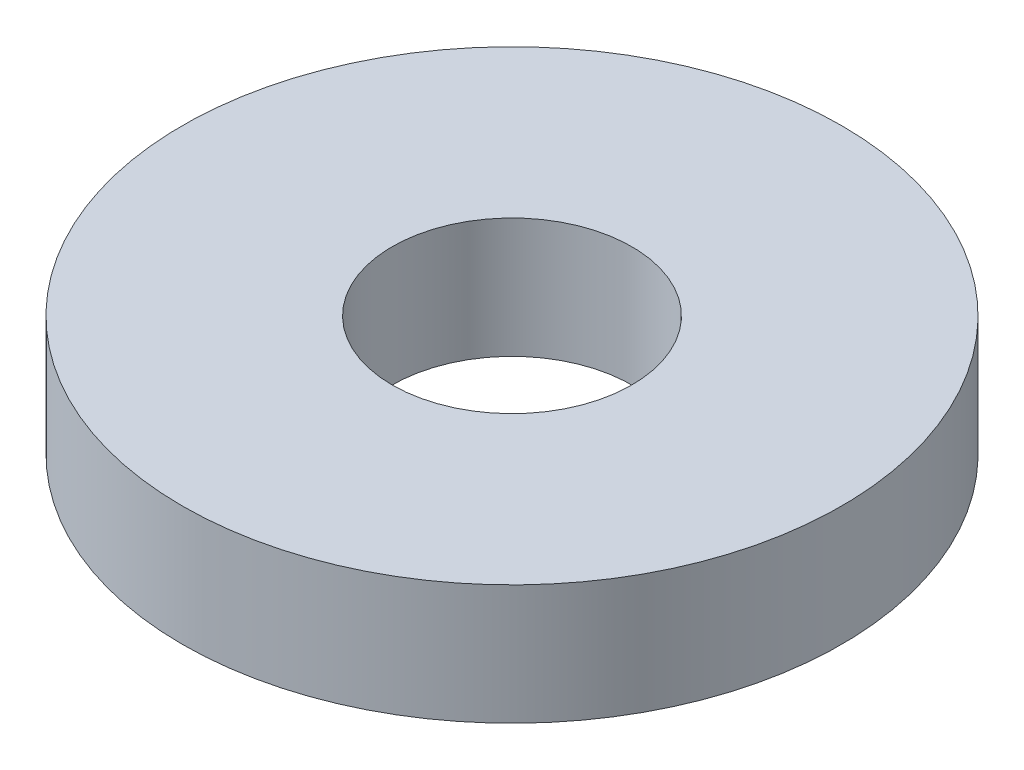
ISO-10303-21;
HEADER;
FILE_DESCRIPTION(('STEP AP214'),'2;1');
FILE_NAME('part.step','',(''),(''),'','','');
FILE_SCHEMA(('AUTOMOTIVE_DESIGN { 1 0 10303 214 1 1 1 1 }'));
ENDSEC;
DATA;
#1=APPLICATION_CONTEXT('core data for automotive mechanical design processes');
#2=APPLICATION_PROTOCOL_DEFINITION('international standard','automotive_design',2000,#1);
#3=PRODUCT_CONTEXT('',#1,'mechanical');
#4=PRODUCT('Part','Part','',(#3));
#5=PRODUCT_RELATED_PRODUCT_CATEGORY('part','',(#4));
#6=PRODUCT_DEFINITION_FORMATION('','',#4);
#7=PRODUCT_DEFINITION_CONTEXT('part definition',#1,'design');
#8=PRODUCT_DEFINITION('design','',#6,#7);
#9=PRODUCT_DEFINITION_SHAPE('','',#8);
#10=(LENGTH_UNIT() NAMED_UNIT(*) SI_UNIT(.MILLI.,.METRE.));
#11=(NAMED_UNIT(*) PLANE_ANGLE_UNIT() SI_UNIT($,.RADIAN.));
#12=(NAMED_UNIT(*) SI_UNIT($,.STERADIAN.) SOLID_ANGLE_UNIT());
#13=UNCERTAINTY_MEASURE_WITH_UNIT(LENGTH_MEASURE(1.E-05),#10,'distance_accuracy_value','');
#14=(GEOMETRIC_REPRESENTATION_CONTEXT(3) GLOBAL_UNCERTAINTY_ASSIGNED_CONTEXT((#13)) GLOBAL_UNIT_ASSIGNED_CONTEXT((#10,
#11,#12)) REPRESENTATION_CONTEXT('',''));
#15=CARTESIAN_POINT('',(0.,0.,0.));
#16=DIRECTION('',(0.,0.,1.));
#17=DIRECTION('',(1.,0.,0.));
#18=AXIS2_PLACEMENT_3D('',#15,#16,#17);
#19=CARTESIAN_POINT('',(0.,10.,0.));
#20=DIRECTION('',(0.,1.,0.));
#21=DIRECTION('',(0.,0.,1.));
#22=AXIS2_PLACEMENT_3D('',#19,#20,#21);
#23=PLANE('',#22);
#24=CARTESIAN_POINT('',(0.,10.,0.));
#25=DIRECTION('',(0.,1.,0.));
#26=DIRECTION('',(0.,0.,1.));
#27=AXIS2_PLACEMENT_3D('',#24,#25,#26);
#28=CIRCLE('',#27,27.5);
#29=CARTESIAN_POINT('',(0.,10.,27.5));
#30=VERTEX_POINT('',#29);
#31=EDGE_CURVE('E10',#30,#30,#28,.T.);
#32=ORIENTED_EDGE('',*,*,#31,.T.);
#33=EDGE_LOOP('',(#32));
#34=FACE_BOUND('',#33,.T.);
#35=CARTESIAN_POINT('',(0.,10.,0.));
#36=DIRECTION('',(0.,1.,0.));
#37=DIRECTION('',(0.,0.,1.));
#38=AXIS2_PLACEMENT_3D('',#35,#36,#37);
#39=CIRCLE('',#38,10.);
#40=CARTESIAN_POINT('',(0.,10.,10.));
#41=VERTEX_POINT('',#40);
#42=EDGE_CURVE('E41',#41,#41,#39,.T.);
#43=ORIENTED_EDGE('',*,*,#42,.F.);
#44=EDGE_LOOP('',(#43));
#45=FACE_BOUND('',#44,.T.);
#46=ADVANCED_FACE('F30',(#34,#45),#23,.T.);
#47=CARTESIAN_POINT('',(0.,0.,0.));
#48=DIRECTION('',(0.,1.,0.));
#49=DIRECTION('',(0.,0.,1.));
#50=AXIS2_PLACEMENT_3D('',#47,#48,#49);
#51=PLANE('',#50);
#52=CARTESIAN_POINT('',(0.,0.,0.));
#53=DIRECTION('',(0.,1.,0.));
#54=DIRECTION('',(0.,0.,1.));
#55=AXIS2_PLACEMENT_3D('',#52,#53,#54);
#56=CIRCLE('',#55,27.5);
#57=CARTESIAN_POINT('',(0.,0.,27.5));
#58=VERTEX_POINT('',#57);
#59=EDGE_CURVE('E34',#58,#58,#56,.T.);
#60=ORIENTED_EDGE('',*,*,#59,.F.);
#61=EDGE_LOOP('',(#60));
#62=FACE_BOUND('',#61,.T.);
#63=CARTESIAN_POINT('',(0.,0.,0.));
#64=DIRECTION('',(0.,1.,0.));
#65=DIRECTION('',(0.,0.,1.));
#66=AXIS2_PLACEMENT_3D('',#63,#64,#65);
#67=CIRCLE('',#66,10.);
#68=CARTESIAN_POINT('',(0.,0.,10.));
#69=VERTEX_POINT('',#68);
#70=EDGE_CURVE('E43',#69,#69,#67,.T.);
#71=ORIENTED_EDGE('',*,*,#70,.T.);
#72=EDGE_LOOP('',(#71));
#73=FACE_BOUND('',#72,.T.);
#74=ADVANCED_FACE('F53',(#62,#73),#51,.F.);
#75=CARTESIAN_POINT('',(0.,10.,0.));
#76=DIRECTION('',(0.,-1.,0.));
#77=DIRECTION('',(0.,0.,-1.));
#78=AXIS2_PLACEMENT_3D('',#75,#76,#77);
#79=CYLINDRICAL_SURFACE('',#78,27.5);
#80=ORIENTED_EDGE('',*,*,#31,.F.);
#81=EDGE_LOOP('',(#80));
#82=FACE_BOUND('',#81,.T.);
#83=ORIENTED_EDGE('',*,*,#59,.T.);
#84=EDGE_LOOP('',(#83));
#85=FACE_BOUND('',#84,.T.);
#86=ADVANCED_FACE('F32',(#82,#85),#79,.T.);
#87=CARTESIAN_POINT('',(0.,10.,0.));
#88=DIRECTION('',(0.,-1.,0.));
#89=DIRECTION('',(0.,0.,-1.));
#90=AXIS2_PLACEMENT_3D('',#87,#88,#89);
#91=CYLINDRICAL_SURFACE('',#90,10.);
#92=ORIENTED_EDGE('',*,*,#42,.T.);
#93=EDGE_LOOP('',(#92));
#94=FACE_BOUND('',#93,.T.);
#95=ORIENTED_EDGE('',*,*,#70,.F.);
#96=EDGE_LOOP('',(#95));
#97=FACE_BOUND('',#96,.T.);
#98=ADVANCED_FACE('F49',(#94,#97),#91,.F.);
#99=CLOSED_SHELL('',(#46,#74,#86,#98));
#100=MANIFOLD_SOLID_BREP('B2',#99);
#101=ADVANCED_BREP_SHAPE_REPRESENTATION('',(#18,#100),#14);
#102=SHAPE_DEFINITION_REPRESENTATION(#9,#101);
ENDSEC;
END-ISO-10303-21;
